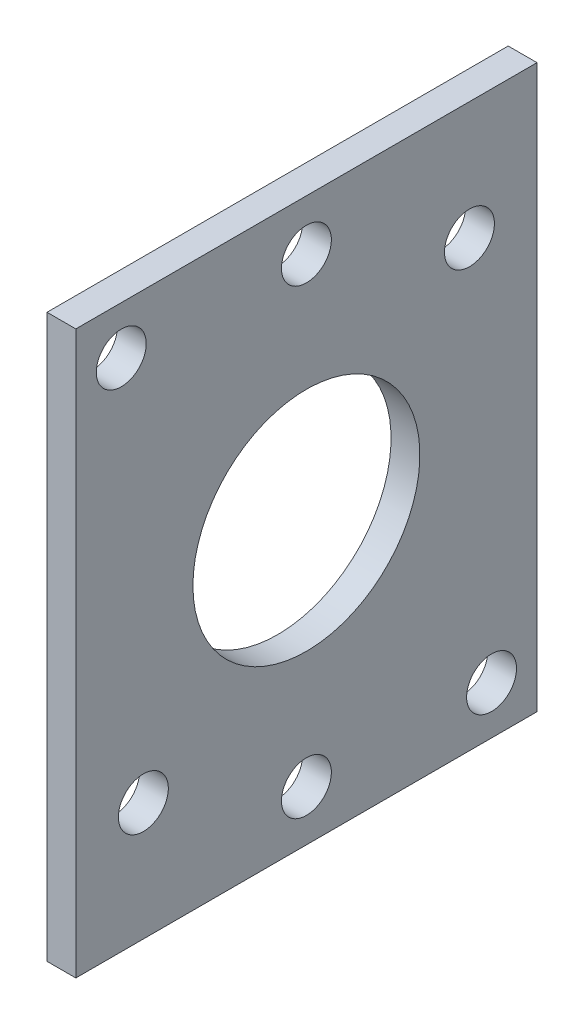
ISO-10303-21;
HEADER;
FILE_DESCRIPTION(('STEP AP214'),'2;1');
FILE_NAME('part.step','',(''),(''),'','','');
FILE_SCHEMA(('AUTOMOTIVE_DESIGN { 1 0 10303 214 1 1 1 1 }'));
ENDSEC;
DATA;
#1=APPLICATION_CONTEXT('core data for automotive mechanical design processes');
#2=APPLICATION_PROTOCOL_DEFINITION('international standard','automotive_design',2000,#1);
#3=PRODUCT_CONTEXT('',#1,'mechanical');
#4=PRODUCT('Part','Part','',(#3));
#5=PRODUCT_RELATED_PRODUCT_CATEGORY('part','',(#4));
#6=PRODUCT_DEFINITION_FORMATION('','',#4);
#7=PRODUCT_DEFINITION_CONTEXT('part definition',#1,'design');
#8=PRODUCT_DEFINITION('design','',#6,#7);
#9=PRODUCT_DEFINITION_SHAPE('','',#8);
#10=(LENGTH_UNIT() NAMED_UNIT(*) SI_UNIT(.MILLI.,.METRE.));
#11=(NAMED_UNIT(*) PLANE_ANGLE_UNIT() SI_UNIT($,.RADIAN.));
#12=(NAMED_UNIT(*) SI_UNIT($,.STERADIAN.) SOLID_ANGLE_UNIT());
#13=UNCERTAINTY_MEASURE_WITH_UNIT(LENGTH_MEASURE(1.E-05),#10,'distance_accuracy_value','');
#14=(GEOMETRIC_REPRESENTATION_CONTEXT(3) GLOBAL_UNCERTAINTY_ASSIGNED_CONTEXT((#13)) GLOBAL_UNIT_ASSIGNED_CONTEXT((#10,
#11,#12)) REPRESENTATION_CONTEXT('',''));
#15=CARTESIAN_POINT('',(0.,0.,0.));
#16=DIRECTION('',(0.,0.,1.));
#17=DIRECTION('',(1.,0.,0.));
#18=AXIS2_PLACEMENT_3D('',#15,#16,#17);
#19=CARTESIAN_POINT('',(3.175,0.,0.));
#20=DIRECTION('',(0.,0.,-1.));
#21=DIRECTION('',(-1.,0.,0.));
#22=AXIS2_PLACEMENT_3D('',#19,#20,#21);
#23=PLANE('',#22);
#24=DIRECTION('',(0.,-1.,0.));
#25=VECTOR('',#24,1.);
#26=CARTESIAN_POINT('',(0.,0.,0.));
#27=LINE('',#26,#25);
#28=CARTESIAN_POINT('',(0.,61.92,0.));
#29=VERTEX_POINT('',#28);
#30=CARTESIAN_POINT('',(0.,0.,0.));
#31=VERTEX_POINT('',#30);
#32=EDGE_CURVE('E102',#29,#31,#27,.T.);
#33=ORIENTED_EDGE('',*,*,#32,.T.);
#34=DIRECTION('',(-1.,0.,0.));
#35=VECTOR('',#34,1.);
#36=CARTESIAN_POINT('',(3.175,0.,0.));
#37=LINE('',#36,#35);
#38=CARTESIAN_POINT('',(3.175,0.,0.));
#39=VERTEX_POINT('',#38);
#40=EDGE_CURVE('E11',#39,#31,#37,.T.);
#41=ORIENTED_EDGE('',*,*,#40,.F.);
#42=DIRECTION('',(0.,-1.,0.));
#43=VECTOR('',#42,1.);
#44=CARTESIAN_POINT('',(3.175,0.,0.));
#45=LINE('',#44,#43);
#46=CARTESIAN_POINT('',(3.175,61.92,0.));
#47=VERTEX_POINT('',#46);
#48=EDGE_CURVE('E90',#47,#39,#45,.T.);
#49=ORIENTED_EDGE('',*,*,#48,.F.);
#50=DIRECTION('',(-1.,0.,0.));
#51=VECTOR('',#50,1.);
#52=CARTESIAN_POINT('',(3.175,61.92,0.));
#53=LINE('',#52,#51);
#54=EDGE_CURVE('E98',#47,#29,#53,.T.);
#55=ORIENTED_EDGE('',*,*,#54,.T.);
#56=EDGE_LOOP('',(#33,#41,#49,#55));
#57=FACE_BOUND('',#56,.T.);
#58=ADVANCED_FACE('F39',(#57),#23,.F.);
#59=CARTESIAN_POINT('',(3.175,0.,0.));
#60=DIRECTION('',(0.,1.,0.));
#61=DIRECTION('',(0.,0.,1.));
#62=AXIS2_PLACEMENT_3D('',#59,#60,#61);
#63=PLANE('',#62);
#64=DIRECTION('',(0.,0.,-1.));
#65=VECTOR('',#64,1.);
#66=CARTESIAN_POINT('',(0.,0.,0.));
#67=LINE('',#66,#65);
#68=CARTESIAN_POINT('',(0.,0.,-50.8));
#69=VERTEX_POINT('',#68);
#70=EDGE_CURVE('E94',#31,#69,#67,.T.);
#71=ORIENTED_EDGE('',*,*,#70,.T.);
#72=DIRECTION('',(-1.,0.,0.));
#73=VECTOR('',#72,1.);
#74=CARTESIAN_POINT('',(3.175,0.,-50.8));
#75=LINE('',#74,#73);
#76=CARTESIAN_POINT('',(3.175,0.,-50.8));
#77=VERTEX_POINT('',#76);
#78=EDGE_CURVE('E47',#77,#69,#75,.T.);
#79=ORIENTED_EDGE('',*,*,#78,.F.);
#80=DIRECTION('',(0.,0.,-1.));
#81=VECTOR('',#80,1.);
#82=CARTESIAN_POINT('',(3.175,0.,0.));
#83=LINE('',#82,#81);
#84=EDGE_CURVE('E85',#39,#77,#83,.T.);
#85=ORIENTED_EDGE('',*,*,#84,.F.);
#86=ORIENTED_EDGE('',*,*,#40,.T.);
#87=EDGE_LOOP('',(#71,#79,#85,#86));
#88=FACE_BOUND('',#87,.T.);
#89=ADVANCED_FACE('F93',(#88),#63,.F.);
#90=CARTESIAN_POINT('',(3.175,0.,-50.8));
#91=DIRECTION('',(0.,0.,1.));
#92=DIRECTION('',(1.,0.,0.));
#93=AXIS2_PLACEMENT_3D('',#90,#91,#92);
#94=PLANE('',#93);
#95=DIRECTION('',(0.,1.,0.));
#96=VECTOR('',#95,1.);
#97=CARTESIAN_POINT('',(0.,0.,-50.8));
#98=LINE('',#97,#96);
#99=CARTESIAN_POINT('',(0.,61.92,-50.8));
#100=VERTEX_POINT('',#99);
#101=EDGE_CURVE('E72',#69,#100,#98,.T.);
#102=ORIENTED_EDGE('',*,*,#101,.T.);
#103=DIRECTION('',(-1.,0.,0.));
#104=VECTOR('',#103,1.);
#105=CARTESIAN_POINT('',(3.175,61.92,-50.8));
#106=LINE('',#105,#104);
#107=CARTESIAN_POINT('',(3.175,61.92,-50.8));
#108=VERTEX_POINT('',#107);
#109=EDGE_CURVE('E95',#108,#100,#106,.T.);
#110=ORIENTED_EDGE('',*,*,#109,.F.);
#111=DIRECTION('',(0.,1.,0.));
#112=VECTOR('',#111,1.);
#113=CARTESIAN_POINT('',(3.175,0.,-50.8));
#114=LINE('',#113,#112);
#115=EDGE_CURVE('E88',#77,#108,#114,.T.);
#116=ORIENTED_EDGE('',*,*,#115,.F.);
#117=ORIENTED_EDGE('',*,*,#78,.T.);
#118=EDGE_LOOP('',(#102,#110,#116,#117));
#119=FACE_BOUND('',#118,.T.);
#120=ADVANCED_FACE('F96',(#119),#94,.F.);
#121=CARTESIAN_POINT('',(3.175,61.92,0.));
#122=DIRECTION('',(0.,-1.,0.));
#123=DIRECTION('',(0.,0.,-1.));
#124=AXIS2_PLACEMENT_3D('',#121,#122,#123);
#125=PLANE('',#124);
#126=DIRECTION('',(0.,0.,1.));
#127=VECTOR('',#126,1.);
#128=CARTESIAN_POINT('',(0.,61.92,0.));
#129=LINE('',#128,#127);
#130=EDGE_CURVE('E78',#100,#29,#129,.T.);
#131=ORIENTED_EDGE('',*,*,#130,.T.);
#132=ORIENTED_EDGE('',*,*,#54,.F.);
#133=DIRECTION('',(0.,0.,1.));
#134=VECTOR('',#133,1.);
#135=CARTESIAN_POINT('',(3.175,61.92,0.));
#136=LINE('',#135,#134);
#137=EDGE_CURVE('E55',#108,#47,#136,.T.);
#138=ORIENTED_EDGE('',*,*,#137,.F.);
#139=ORIENTED_EDGE('',*,*,#109,.T.);
#140=EDGE_LOOP('',(#131,#132,#138,#139));
#141=FACE_BOUND('',#140,.T.);
#142=ADVANCED_FACE('F110',(#141),#125,.F.);
#143=CARTESIAN_POINT('',(3.175,0.,0.));
#144=DIRECTION('',(-1.,0.,0.));
#145=DIRECTION('',(0.,0.,1.));
#146=AXIS2_PLACEMENT_3D('',#143,#144,#145);
#147=PLANE('',#146);
#148=CARTESIAN_POINT('',(3.175,5.56069499999992,-25.3996554046469));
#149=DIRECTION('',(-1.,0.,0.));
#150=DIRECTION('',(0.,0.,1.));
#151=AXIS2_PLACEMENT_3D('',#148,#149,#150);
#152=CIRCLE('',#151,2.75);
#153=CARTESIAN_POINT('',(3.175,5.56069499999992,-22.6496554046469));
#154=VERTEX_POINT('',#153);
#155=EDGE_CURVE('E134',#154,#154,#152,.T.);
#156=ORIENTED_EDGE('',*,*,#155,.T.);
#157=EDGE_LOOP('',(#156));
#158=FACE_BOUND('',#157,.T.);
#159=CARTESIAN_POINT('',(3.175,56.6480871347203,-5.00450452609199));
#160=DIRECTION('',(-1.,0.,0.));
#161=DIRECTION('',(0.,0.,1.));
#162=AXIS2_PLACEMENT_3D('',#159,#160,#161);
#163=CIRCLE('',#162,2.75);
#164=CARTESIAN_POINT('',(3.175,56.6480871347203,-2.25450452609199));
#165=VERTEX_POINT('',#164);
#166=EDGE_CURVE('E141',#165,#165,#163,.T.);
#167=ORIENTED_EDGE('',*,*,#166,.T.);
#168=EDGE_LOOP('',(#167));
#169=FACE_BOUND('',#168,.T.);
#170=CARTESIAN_POINT('',(3.175,56.36,-25.3996554046469));
#171=DIRECTION('',(-1.,0.,0.));
#172=DIRECTION('',(0.,0.,1.));
#173=AXIS2_PLACEMENT_3D('',#170,#171,#172);
#174=CIRCLE('',#173,2.74999999999999);
#175=CARTESIAN_POINT('',(3.175,56.36,-22.6496554046469));
#176=VERTEX_POINT('',#175);
#177=EDGE_CURVE('E122',#176,#176,#174,.T.);
#178=ORIENTED_EDGE('',*,*,#177,.T.);
#179=EDGE_LOOP('',(#178));
#180=FACE_BOUND('',#179,.T.);
#181=CARTESIAN_POINT('',(3.175,48.9207559055118,-43.3599239801059));
#182=DIRECTION('',(-1.,0.,0.));
#183=DIRECTION('',(0.,0.,1.));
#184=AXIS2_PLACEMENT_3D('',#181,#182,#183);
#185=CIRCLE('',#184,2.75);
#186=CARTESIAN_POINT('',(3.175,48.9207559055118,-40.6099239801059));
#187=VERTEX_POINT('',#186);
#188=EDGE_CURVE('E129',#187,#187,#185,.T.);
#189=ORIENTED_EDGE('',*,*,#188,.T.);
#190=EDGE_LOOP('',(#189));
#191=FACE_BOUND('',#190,.T.);
#192=CARTESIAN_POINT('',(3.175,5.27247112124181,-45.795509397627));
#193=DIRECTION('',(-1.,0.,0.));
#194=DIRECTION('',(0.,0.,1.));
#195=AXIS2_PLACEMENT_3D('',#192,#193,#194);
#196=CIRCLE('',#195,2.75);
#197=CARTESIAN_POINT('',(3.175,5.27247112124181,-43.045509397627));
#198=VERTEX_POINT('',#197);
#199=EDGE_CURVE('E152',#198,#198,#196,.T.);
#200=ORIENTED_EDGE('',*,*,#199,.T.);
#201=EDGE_LOOP('',(#200));
#202=FACE_BOUND('',#201,.T.);
#203=CARTESIAN_POINT('',(3.175,13.0001827578616,-7.43948775786178));
#204=DIRECTION('',(-1.,0.,0.));
#205=DIRECTION('',(0.,0.,1.));
#206=AXIS2_PLACEMENT_3D('',#203,#204,#205);
#207=CIRCLE('',#206,2.75);
#208=CARTESIAN_POINT('',(3.175,13.0001827578616,-4.68948775786178));
#209=VERTEX_POINT('',#208);
#210=EDGE_CURVE('E146',#209,#209,#207,.T.);
#211=ORIENTED_EDGE('',*,*,#210,.T.);
#212=EDGE_LOOP('',(#211));
#213=FACE_BOUND('',#212,.T.);
#214=CARTESIAN_POINT('',(3.175,30.96,-25.3996554046469));
#215=DIRECTION('',(-1.,0.,0.));
#216=DIRECTION('',(0.,0.,1.));
#217=AXIS2_PLACEMENT_3D('',#214,#215,#216);
#218=CIRCLE('',#217,12.5);
#219=CARTESIAN_POINT('',(3.175,30.96,-12.8996554046469));
#220=VERTEX_POINT('',#219);
#221=EDGE_CURVE('E105',#220,#220,#218,.T.);
#222=ORIENTED_EDGE('',*,*,#221,.T.);
#223=EDGE_LOOP('',(#222));
#224=FACE_BOUND('',#223,.T.);
#225=ORIENTED_EDGE('',*,*,#48,.T.);
#226=ORIENTED_EDGE('',*,*,#84,.T.);
#227=ORIENTED_EDGE('',*,*,#115,.T.);
#228=ORIENTED_EDGE('',*,*,#137,.T.);
#229=EDGE_LOOP('',(#225,#226,#227,#228));
#230=FACE_BOUND('',#229,.T.);
#231=ADVANCED_FACE('F86',(#158,#169,#180,#191,#202,#213,#224,#230),#147,.F.);
#232=CARTESIAN_POINT('',(0.,0.,0.));
#233=DIRECTION('',(-1.,0.,0.));
#234=DIRECTION('',(0.,0.,1.));
#235=AXIS2_PLACEMENT_3D('',#232,#233,#234);
#236=PLANE('',#235);
#237=CARTESIAN_POINT('',(0.,5.56069499999992,-25.3996554046469));
#238=DIRECTION('',(-1.,0.,0.));
#239=DIRECTION('',(0.,0.,1.));
#240=AXIS2_PLACEMENT_3D('',#237,#238,#239);
#241=CIRCLE('',#240,2.75);
#242=CARTESIAN_POINT('',(0.,5.56069499999992,-22.6496554046469));
#243=VERTEX_POINT('',#242);
#244=EDGE_CURVE('E137',#243,#243,#241,.T.);
#245=ORIENTED_EDGE('',*,*,#244,.F.);
#246=EDGE_LOOP('',(#245));
#247=FACE_BOUND('',#246,.T.);
#248=CARTESIAN_POINT('',(0.,56.6480871347203,-5.00450452609199));
#249=DIRECTION('',(-1.,0.,0.));
#250=DIRECTION('',(0.,0.,1.));
#251=AXIS2_PLACEMENT_3D('',#248,#249,#250);
#252=CIRCLE('',#251,2.75);
#253=CARTESIAN_POINT('',(0.,56.6480871347203,-2.25450452609199));
#254=VERTEX_POINT('',#253);
#255=EDGE_CURVE('E126',#254,#254,#252,.T.);
#256=ORIENTED_EDGE('',*,*,#255,.F.);
#257=EDGE_LOOP('',(#256));
#258=FACE_BOUND('',#257,.T.);
#259=CARTESIAN_POINT('',(0.,56.36,-25.3996554046469));
#260=DIRECTION('',(-1.,0.,0.));
#261=DIRECTION('',(0.,0.,1.));
#262=AXIS2_PLACEMENT_3D('',#259,#260,#261);
#263=CIRCLE('',#262,2.74999999999999);
#264=CARTESIAN_POINT('',(0.,56.36,-22.6496554046469));
#265=VERTEX_POINT('',#264);
#266=EDGE_CURVE('E125',#265,#265,#263,.T.);
#267=ORIENTED_EDGE('',*,*,#266,.F.);
#268=EDGE_LOOP('',(#267));
#269=FACE_BOUND('',#268,.T.);
#270=CARTESIAN_POINT('',(0.,48.9207559055118,-43.3599239801059));
#271=DIRECTION('',(-1.,0.,0.));
#272=DIRECTION('',(0.,0.,1.));
#273=AXIS2_PLACEMENT_3D('',#270,#271,#272);
#274=CIRCLE('',#273,2.75);
#275=CARTESIAN_POINT('',(0.,48.9207559055118,-40.6099239801059));
#276=VERTEX_POINT('',#275);
#277=EDGE_CURVE('E119',#276,#276,#274,.T.);
#278=ORIENTED_EDGE('',*,*,#277,.F.);
#279=EDGE_LOOP('',(#278));
#280=FACE_BOUND('',#279,.T.);
#281=CARTESIAN_POINT('',(0.,5.27247112124181,-45.795509397627));
#282=DIRECTION('',(-1.,0.,0.));
#283=DIRECTION('',(0.,0.,1.));
#284=AXIS2_PLACEMENT_3D('',#281,#282,#283);
#285=CIRCLE('',#284,2.75);
#286=CARTESIAN_POINT('',(0.,5.27247112124181,-43.045509397627));
#287=VERTEX_POINT('',#286);
#288=EDGE_CURVE('E138',#287,#287,#285,.T.);
#289=ORIENTED_EDGE('',*,*,#288,.F.);
#290=EDGE_LOOP('',(#289));
#291=FACE_BOUND('',#290,.T.);
#292=CARTESIAN_POINT('',(0.,13.0001827578616,-7.43948775786178));
#293=DIRECTION('',(-1.,0.,0.));
#294=DIRECTION('',(0.,0.,1.));
#295=AXIS2_PLACEMENT_3D('',#292,#293,#294);
#296=CIRCLE('',#295,2.75);
#297=CARTESIAN_POINT('',(0.,13.0001827578616,-4.68948775786178));
#298=VERTEX_POINT('',#297);
#299=EDGE_CURVE('E149',#298,#298,#296,.T.);
#300=ORIENTED_EDGE('',*,*,#299,.F.);
#301=EDGE_LOOP('',(#300));
#302=FACE_BOUND('',#301,.T.);
#303=CARTESIAN_POINT('',(0.,30.96,-25.3996554046469));
#304=DIRECTION('',(-1.,0.,0.));
#305=DIRECTION('',(0.,0.,1.));
#306=AXIS2_PLACEMENT_3D('',#303,#304,#305);
#307=CIRCLE('',#306,12.5);
#308=CARTESIAN_POINT('',(0.,30.96,-12.8996554046469));
#309=VERTEX_POINT('',#308);
#310=EDGE_CURVE('E116',#309,#309,#307,.T.);
#311=ORIENTED_EDGE('',*,*,#310,.F.);
#312=EDGE_LOOP('',(#311));
#313=FACE_BOUND('',#312,.T.);
#314=ORIENTED_EDGE('',*,*,#32,.F.);
#315=ORIENTED_EDGE('',*,*,#130,.F.);
#316=ORIENTED_EDGE('',*,*,#101,.F.);
#317=ORIENTED_EDGE('',*,*,#70,.F.);
#318=EDGE_LOOP('',(#314,#315,#316,#317));
#319=FACE_BOUND('',#318,.T.);
#320=ADVANCED_FACE('F113',(#247,#258,#269,#280,#291,#302,#313,#319),#236,.T.);
#321=CARTESIAN_POINT('',(3.175,30.96,-25.3996554046469));
#322=DIRECTION('',(-1.,0.,0.));
#323=DIRECTION('',(0.,0.,1.));
#324=AXIS2_PLACEMENT_3D('',#321,#322,#323);
#325=CYLINDRICAL_SURFACE('',#324,12.5);
#326=ORIENTED_EDGE('',*,*,#221,.F.);
#327=EDGE_LOOP('',(#326));
#328=FACE_BOUND('',#327,.T.);
#329=ORIENTED_EDGE('',*,*,#310,.T.);
#330=EDGE_LOOP('',(#329));
#331=FACE_BOUND('',#330,.T.);
#332=ADVANCED_FACE('F162',(#328,#331),#325,.F.);
#333=CARTESIAN_POINT('',(3.175,13.0001827578616,-7.43948775786178));
#334=DIRECTION('',(-1.,0.,0.));
#335=DIRECTION('',(0.,0.,1.));
#336=AXIS2_PLACEMENT_3D('',#333,#334,#335);
#337=CYLINDRICAL_SURFACE('',#336,2.75);
#338=ORIENTED_EDGE('',*,*,#210,.F.);
#339=EDGE_LOOP('',(#338));
#340=FACE_BOUND('',#339,.T.);
#341=ORIENTED_EDGE('',*,*,#299,.T.);
#342=EDGE_LOOP('',(#341));
#343=FACE_BOUND('',#342,.T.);
#344=ADVANCED_FACE('F170',(#340,#343),#337,.F.);
#345=CARTESIAN_POINT('',(3.175,5.27247112124181,-45.795509397627));
#346=DIRECTION('',(-1.,0.,0.));
#347=DIRECTION('',(0.,0.,1.));
#348=AXIS2_PLACEMENT_3D('',#345,#346,#347);
#349=CYLINDRICAL_SURFACE('',#348,2.75);
#350=ORIENTED_EDGE('',*,*,#199,.F.);
#351=EDGE_LOOP('',(#350));
#352=FACE_BOUND('',#351,.T.);
#353=ORIENTED_EDGE('',*,*,#288,.T.);
#354=EDGE_LOOP('',(#353));
#355=FACE_BOUND('',#354,.T.);
#356=ADVANCED_FACE('F158',(#352,#355),#349,.F.);
#357=CARTESIAN_POINT('',(3.175,48.9207559055118,-43.3599239801059));
#358=DIRECTION('',(-1.,0.,0.));
#359=DIRECTION('',(0.,0.,1.));
#360=AXIS2_PLACEMENT_3D('',#357,#358,#359);
#361=CYLINDRICAL_SURFACE('',#360,2.75);
#362=ORIENTED_EDGE('',*,*,#188,.F.);
#363=EDGE_LOOP('',(#362));
#364=FACE_BOUND('',#363,.T.);
#365=ORIENTED_EDGE('',*,*,#277,.T.);
#366=EDGE_LOOP('',(#365));
#367=FACE_BOUND('',#366,.T.);
#368=ADVANCED_FACE('F210',(#364,#367),#361,.F.);
#369=CARTESIAN_POINT('',(3.175,56.36,-25.3996554046469));
#370=DIRECTION('',(-1.,0.,0.));
#371=DIRECTION('',(0.,0.,1.));
#372=AXIS2_PLACEMENT_3D('',#369,#370,#371);
#373=CYLINDRICAL_SURFACE('',#372,2.74999999999999);
#374=ORIENTED_EDGE('',*,*,#177,.F.);
#375=EDGE_LOOP('',(#374));
#376=FACE_BOUND('',#375,.T.);
#377=ORIENTED_EDGE('',*,*,#266,.T.);
#378=EDGE_LOOP('',(#377));
#379=FACE_BOUND('',#378,.T.);
#380=ADVANCED_FACE('F215',(#376,#379),#373,.F.);
#381=CARTESIAN_POINT('',(3.175,56.6480871347203,-5.00450452609199));
#382=DIRECTION('',(-1.,0.,0.));
#383=DIRECTION('',(0.,0.,1.));
#384=AXIS2_PLACEMENT_3D('',#381,#382,#383);
#385=CYLINDRICAL_SURFACE('',#384,2.75);
#386=ORIENTED_EDGE('',*,*,#166,.F.);
#387=EDGE_LOOP('',(#386));
#388=FACE_BOUND('',#387,.T.);
#389=ORIENTED_EDGE('',*,*,#255,.T.);
#390=EDGE_LOOP('',(#389));
#391=FACE_BOUND('',#390,.T.);
#392=ADVANCED_FACE('F219',(#388,#391),#385,.F.);
#393=CARTESIAN_POINT('',(3.175,5.56069499999992,-25.3996554046469));
#394=DIRECTION('',(-1.,0.,0.));
#395=DIRECTION('',(0.,0.,1.));
#396=AXIS2_PLACEMENT_3D('',#393,#394,#395);
#397=CYLINDRICAL_SURFACE('',#396,2.75);
#398=ORIENTED_EDGE('',*,*,#155,.F.);
#399=EDGE_LOOP('',(#398));
#400=FACE_BOUND('',#399,.T.);
#401=ORIENTED_EDGE('',*,*,#244,.T.);
#402=EDGE_LOOP('',(#401));
#403=FACE_BOUND('',#402,.T.);
#404=ADVANCED_FACE('F222',(#400,#403),#397,.F.);
#405=CLOSED_SHELL('',(#58,#89,#120,#142,#231,#320,#332,#344,#356,#368,#380,#392,#404));
#406=MANIFOLD_SOLID_BREP('B2',#405);
#407=ADVANCED_BREP_SHAPE_REPRESENTATION('',(#18,#406),#14);
#408=SHAPE_DEFINITION_REPRESENTATION(#9,#407);
ENDSEC;
END-ISO-10303-21;
